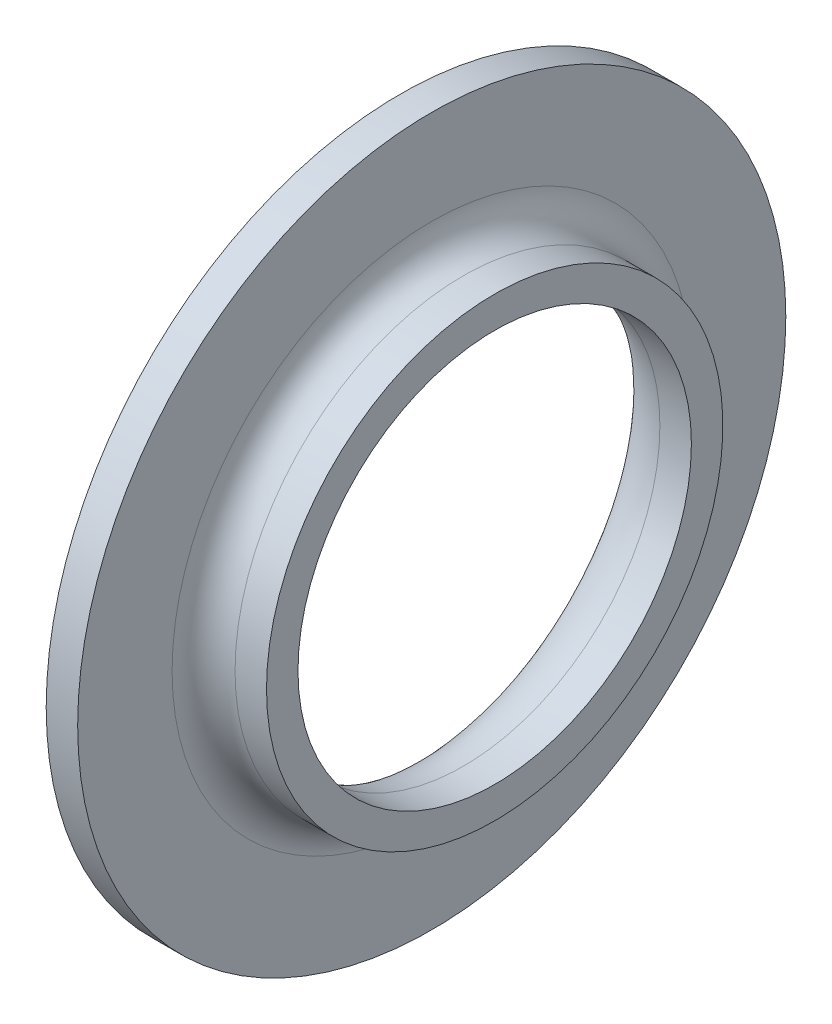
ISO-10303-21;
HEADER;
FILE_DESCRIPTION(('STEP AP214'),'2;1');
FILE_NAME('part.step','',(''),(''),'','','');
FILE_SCHEMA(('AUTOMOTIVE_DESIGN { 1 0 10303 214 1 1 1 1 }'));
ENDSEC;
DATA;
#1=APPLICATION_CONTEXT('core data for automotive mechanical design processes');
#2=APPLICATION_PROTOCOL_DEFINITION('international standard','automotive_design',2000,#1);
#3=PRODUCT_CONTEXT('',#1,'mechanical');
#4=PRODUCT('Part','Part','',(#3));
#5=PRODUCT_RELATED_PRODUCT_CATEGORY('part','',(#4));
#6=PRODUCT_DEFINITION_FORMATION('','',#4);
#7=PRODUCT_DEFINITION_CONTEXT('part definition',#1,'design');
#8=PRODUCT_DEFINITION('design','',#6,#7);
#9=PRODUCT_DEFINITION_SHAPE('','',#8);
#10=(LENGTH_UNIT() NAMED_UNIT(*) SI_UNIT(.MILLI.,.METRE.));
#11=(NAMED_UNIT(*) PLANE_ANGLE_UNIT() SI_UNIT($,.RADIAN.));
#12=(NAMED_UNIT(*) SI_UNIT($,.STERADIAN.) SOLID_ANGLE_UNIT());
#13=UNCERTAINTY_MEASURE_WITH_UNIT(LENGTH_MEASURE(1.E-05),#10,'distance_accuracy_value','');
#14=(GEOMETRIC_REPRESENTATION_CONTEXT(3) GLOBAL_UNCERTAINTY_ASSIGNED_CONTEXT((#13)) GLOBAL_UNIT_ASSIGNED_CONTEXT((#10,
#11,#12)) REPRESENTATION_CONTEXT('',''));
#15=CARTESIAN_POINT('',(0.,0.,0.));
#16=DIRECTION('',(0.,0.,1.));
#17=DIRECTION('',(1.,0.,0.));
#18=AXIS2_PLACEMENT_3D('',#15,#16,#17);
#19=CARTESIAN_POINT('',(4.,45.,0.));
#20=DIRECTION('',(-1.,0.,0.));
#21=DIRECTION('',(0.,0.,1.));
#22=AXIS2_PLACEMENT_3D('',#19,#20,#21);
#23=PLANE('',#22);
#24=CARTESIAN_POINT('',(4.,0.,0.));
#25=DIRECTION('',(-1.,0.,0.));
#26=DIRECTION('',(0.,0.,1.));
#27=AXIS2_PLACEMENT_3D('',#24,#25,#26);
#28=CIRCLE('',#27,45.);
#29=CARTESIAN_POINT('',(4.,0.,45.));
#30=VERTEX_POINT('',#29);
#31=EDGE_CURVE('E10',#30,#30,#28,.T.);
#32=ORIENTED_EDGE('',*,*,#31,.F.);
#33=EDGE_LOOP('',(#32));
#34=FACE_BOUND('',#33,.T.);
#35=CARTESIAN_POINT('',(4.,0.,0.));
#36=DIRECTION('',(-1.,0.,0.));
#37=DIRECTION('',(0.,0.,1.));
#38=AXIS2_PLACEMENT_3D('',#35,#36,#37);
#39=CIRCLE('',#38,33.);
#40=CARTESIAN_POINT('',(4.,0.,33.));
#41=VERTEX_POINT('',#40);
#42=EDGE_CURVE('E76',#41,#41,#39,.T.);
#43=ORIENTED_EDGE('',*,*,#42,.T.);
#44=EDGE_LOOP('',(#43));
#45=FACE_BOUND('',#44,.T.);
#46=ADVANCED_FACE('F41',(#34,#45),#23,.F.);
#47=CARTESIAN_POINT('',(0.,0.,0.));
#48=DIRECTION('',(-1.,0.,0.));
#49=DIRECTION('',(0.,0.,1.));
#50=AXIS2_PLACEMENT_3D('',#47,#48,#49);
#51=CYLINDRICAL_SURFACE('',#50,45.);
#52=CARTESIAN_POINT('',(0.,0.,0.));
#53=DIRECTION('',(-1.,0.,0.));
#54=DIRECTION('',(0.,0.,1.));
#55=AXIS2_PLACEMENT_3D('',#52,#53,#54);
#56=CIRCLE('',#55,45.);
#57=CARTESIAN_POINT('',(0.,0.,45.));
#58=VERTEX_POINT('',#57);
#59=EDGE_CURVE('E48',#58,#58,#56,.T.);
#60=ORIENTED_EDGE('',*,*,#59,.F.);
#61=EDGE_LOOP('',(#60));
#62=FACE_BOUND('',#61,.T.);
#63=ORIENTED_EDGE('',*,*,#31,.T.);
#64=EDGE_LOOP('',(#63));
#65=FACE_BOUND('',#64,.T.);
#66=ADVANCED_FACE('F114',(#62,#65),#51,.T.);
#67=CARTESIAN_POINT('',(0.,33.,0.));
#68=DIRECTION('',(1.,0.,0.));
#69=DIRECTION('',(0.,0.,-1.));
#70=AXIS2_PLACEMENT_3D('',#67,#68,#69);
#71=PLANE('',#70);
#72=CARTESIAN_POINT('',(0.,0.,0.));
#73=DIRECTION('',(-1.,0.,0.));
#74=DIRECTION('',(0.,0.,1.));
#75=AXIS2_PLACEMENT_3D('',#72,#73,#74);
#76=CIRCLE('',#75,33.);
#77=CARTESIAN_POINT('',(0.,0.,33.));
#78=VERTEX_POINT('',#77);
#79=EDGE_CURVE('E53',#78,#78,#76,.T.);
#80=ORIENTED_EDGE('',*,*,#79,.F.);
#81=EDGE_LOOP('',(#80));
#82=FACE_BOUND('',#81,.T.);
#83=ORIENTED_EDGE('',*,*,#59,.T.);
#84=EDGE_LOOP('',(#83));
#85=FACE_BOUND('',#84,.T.);
#86=ADVANCED_FACE('F109',(#82,#85),#71,.F.);
#87=CARTESIAN_POINT('',(8.,0.,0.));
#88=DIRECTION('',(-1.,0.,0.));
#89=DIRECTION('',(0.,0.,1.));
#90=AXIS2_PLACEMENT_3D('',#87,#88,#89);
#91=TOROIDAL_SURFACE('',#90,33.,8.);
#92=CARTESIAN_POINT('',(8.,0.,0.));
#93=DIRECTION('',(-1.,0.,0.));
#94=DIRECTION('',(0.,0.,1.));
#95=AXIS2_PLACEMENT_3D('',#92,#93,#94);
#96=CIRCLE('',#95,25.);
#97=CARTESIAN_POINT('',(8.,0.,25.));
#98=VERTEX_POINT('',#97);
#99=EDGE_CURVE('E58',#98,#98,#96,.T.);
#100=ORIENTED_EDGE('',*,*,#99,.F.);
#101=EDGE_LOOP('',(#100));
#102=FACE_BOUND('',#101,.T.);
#103=ORIENTED_EDGE('',*,*,#79,.T.);
#104=EDGE_LOOP('',(#103));
#105=FACE_BOUND('',#104,.T.);
#106=ADVANCED_FACE('F103',(#102,#105),#91,.T.);
#107=CARTESIAN_POINT('',(0.,0.,0.));
#108=DIRECTION('',(-1.,0.,0.));
#109=DIRECTION('',(0.,0.,1.));
#110=AXIS2_PLACEMENT_3D('',#107,#108,#109);
#111=CYLINDRICAL_SURFACE('',#110,25.);
#112=CARTESIAN_POINT('',(12.,0.,0.));
#113=DIRECTION('',(-1.,0.,0.));
#114=DIRECTION('',(0.,0.,1.));
#115=AXIS2_PLACEMENT_3D('',#112,#113,#114);
#116=CIRCLE('',#115,25.);
#117=CARTESIAN_POINT('',(12.,0.,25.));
#118=VERTEX_POINT('',#117);
#119=EDGE_CURVE('E64',#118,#118,#116,.T.);
#120=ORIENTED_EDGE('',*,*,#119,.F.);
#121=EDGE_LOOP('',(#120));
#122=FACE_BOUND('',#121,.T.);
#123=ORIENTED_EDGE('',*,*,#99,.T.);
#124=EDGE_LOOP('',(#123));
#125=FACE_BOUND('',#124,.T.);
#126=ADVANCED_FACE('F97',(#122,#125),#111,.F.);
#127=CARTESIAN_POINT('',(12.,29.,0.));
#128=DIRECTION('',(-1.,0.,0.));
#129=DIRECTION('',(0.,0.,1.));
#130=AXIS2_PLACEMENT_3D('',#127,#128,#129);
#131=PLANE('',#130);
#132=CARTESIAN_POINT('',(12.,0.,0.));
#133=DIRECTION('',(-1.,0.,0.));
#134=DIRECTION('',(0.,0.,1.));
#135=AXIS2_PLACEMENT_3D('',#132,#133,#134);
#136=CIRCLE('',#135,29.);
#137=CARTESIAN_POINT('',(12.,0.,29.));
#138=VERTEX_POINT('',#137);
#139=EDGE_CURVE('E68',#138,#138,#136,.T.);
#140=ORIENTED_EDGE('',*,*,#139,.F.);
#141=EDGE_LOOP('',(#140));
#142=FACE_BOUND('',#141,.T.);
#143=ORIENTED_EDGE('',*,*,#119,.T.);
#144=EDGE_LOOP('',(#143));
#145=FACE_BOUND('',#144,.T.);
#146=ADVANCED_FACE('F91',(#142,#145),#131,.F.);
#147=CARTESIAN_POINT('',(0.,0.,0.));
#148=DIRECTION('',(-1.,0.,0.));
#149=DIRECTION('',(0.,0.,1.));
#150=AXIS2_PLACEMENT_3D('',#147,#148,#149);
#151=CYLINDRICAL_SURFACE('',#150,29.);
#152=CARTESIAN_POINT('',(8.,0.,0.));
#153=DIRECTION('',(-1.,0.,0.));
#154=DIRECTION('',(0.,0.,1.));
#155=AXIS2_PLACEMENT_3D('',#152,#153,#154);
#156=CIRCLE('',#155,29.);
#157=CARTESIAN_POINT('',(8.,0.,29.));
#158=VERTEX_POINT('',#157);
#159=EDGE_CURVE('E72',#158,#158,#156,.T.);
#160=ORIENTED_EDGE('',*,*,#159,.F.);
#161=EDGE_LOOP('',(#160));
#162=FACE_BOUND('',#161,.T.);
#163=ORIENTED_EDGE('',*,*,#139,.T.);
#164=EDGE_LOOP('',(#163));
#165=FACE_BOUND('',#164,.T.);
#166=ADVANCED_FACE('F85',(#162,#165),#151,.T.);
#167=CARTESIAN_POINT('',(8.,0.,0.));
#168=DIRECTION('',(-1.,0.,0.));
#169=DIRECTION('',(0.,0.,1.));
#170=AXIS2_PLACEMENT_3D('',#167,#168,#169);
#171=TOROIDAL_SURFACE('',#170,33.,4.);
#172=ORIENTED_EDGE('',*,*,#42,.F.);
#173=EDGE_LOOP('',(#172));
#174=FACE_BOUND('',#173,.T.);
#175=ORIENTED_EDGE('',*,*,#159,.T.);
#176=EDGE_LOOP('',(#175));
#177=FACE_BOUND('',#176,.T.);
#178=ADVANCED_FACE('F82',(#174,#177),#171,.F.);
#179=CLOSED_SHELL('',(#46,#66,#86,#106,#126,#146,#166,#178));
#180=MANIFOLD_SOLID_BREP('B2',#179);
#181=ADVANCED_BREP_SHAPE_REPRESENTATION('',(#18,#180),#14);
#182=SHAPE_DEFINITION_REPRESENTATION(#9,#181);
ENDSEC;
END-ISO-10303-21;
